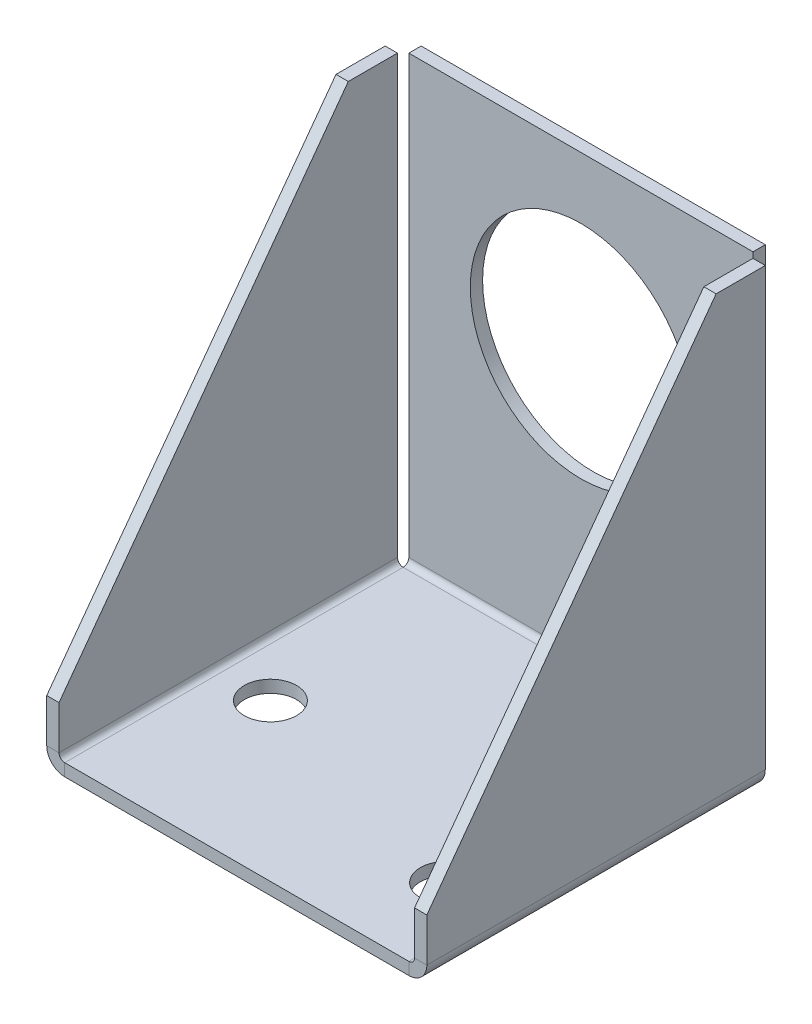
ISO-10303-21;
HEADER;
FILE_DESCRIPTION(('STEP AP214'),'2;1');
FILE_NAME('part.step','',(''),(''),'','','');
FILE_SCHEMA(('AUTOMOTIVE_DESIGN { 1 0 10303 214 1 1 1 1 }'));
ENDSEC;
DATA;
#1=APPLICATION_CONTEXT('core data for automotive mechanical design processes');
#2=APPLICATION_PROTOCOL_DEFINITION('international standard','automotive_design',2000,#1);
#3=PRODUCT_CONTEXT('',#1,'mechanical');
#4=PRODUCT('Part','Part','',(#3));
#5=PRODUCT_RELATED_PRODUCT_CATEGORY('part','',(#4));
#6=PRODUCT_DEFINITION_FORMATION('','',#4);
#7=PRODUCT_DEFINITION_CONTEXT('part definition',#1,'design');
#8=PRODUCT_DEFINITION('design','',#6,#7);
#9=PRODUCT_DEFINITION_SHAPE('','',#8);
#10=(LENGTH_UNIT() NAMED_UNIT(*) SI_UNIT(.MILLI.,.METRE.));
#11=(NAMED_UNIT(*) PLANE_ANGLE_UNIT() SI_UNIT($,.RADIAN.));
#12=(NAMED_UNIT(*) SI_UNIT($,.STERADIAN.) SOLID_ANGLE_UNIT());
#13=UNCERTAINTY_MEASURE_WITH_UNIT(LENGTH_MEASURE(1.E-05),#10,'distance_accuracy_value','');
#14=(GEOMETRIC_REPRESENTATION_CONTEXT(3) GLOBAL_UNCERTAINTY_ASSIGNED_CONTEXT((#13)) GLOBAL_UNIT_ASSIGNED_CONTEXT((#10,
#11,#12)) REPRESENTATION_CONTEXT('',''));
#15=CARTESIAN_POINT('',(0.,0.,0.));
#16=DIRECTION('',(0.,0.,1.));
#17=DIRECTION('',(1.,0.,0.));
#18=AXIS2_PLACEMENT_3D('',#15,#16,#17);
#19=CARTESIAN_POINT('',(44.45,0.7366,-44.45));
#20=DIRECTION('',(1.,0.,0.));
#21=DIRECTION('',(0.,0.,-1.));
#22=AXIS2_PLACEMENT_3D('',#19,#20,#21);
#23=PLANE('',#22);
#24=DIRECTION('',(0.,0.,-1.));
#25=VECTOR('',#24,1.);
#26=CARTESIAN_POINT('',(44.45,0.7366,-44.45));
#27=LINE('',#26,#25);
#28=CARTESIAN_POINT('',(44.45,0.7366,-44.45));
#29=VERTEX_POINT('',#28);
#30=CARTESIAN_POINT('',(44.45,0.7366,-46.0375));
#31=VERTEX_POINT('',#30);
#32=EDGE_CURVE('E13',#29,#31,#27,.T.);
#33=ORIENTED_EDGE('',*,*,#32,.F.);
#34=CARTESIAN_POINT('',(44.45,0.7366,-43.7134));
#35=DIRECTION('',(-1.,0.,0.));
#36=DIRECTION('',(0.,0.,1.));
#37=AXIS2_PLACEMENT_3D('',#34,#35,#36);
#38=CIRCLE('',#37,0.7366);
#39=CARTESIAN_POINT('',(44.45,0.,-43.7134));
#40=VERTEX_POINT('',#39);
#41=EDGE_CURVE('E197',#40,#29,#38,.F.);
#42=ORIENTED_EDGE('',*,*,#41,.F.);
#43=DIRECTION('',(0.,1.,0.));
#44=VECTOR('',#43,1.);
#45=CARTESIAN_POINT('',(44.45,-1.5875,-43.7134));
#46=LINE('',#45,#44);
#47=CARTESIAN_POINT('',(44.45,-1.5875,-43.7134));
#48=VERTEX_POINT('',#47);
#49=EDGE_CURVE('E103',#48,#40,#46,.T.);
#50=ORIENTED_EDGE('',*,*,#49,.F.);
#51=CARTESIAN_POINT('',(44.45,0.7366,-43.7134));
#52=DIRECTION('',(1.,0.,0.));
#53=DIRECTION('',(0.,0.,-1.));
#54=AXIS2_PLACEMENT_3D('',#51,#52,#53);
#55=CIRCLE('',#54,2.3241);
#56=EDGE_CURVE('E279',#48,#31,#55,.T.);
#57=ORIENTED_EDGE('',*,*,#56,.T.);
#58=EDGE_LOOP('',(#33,#42,#50,#57));
#59=FACE_BOUND('',#58,.T.);
#60=ADVANCED_FACE('F94',(#59),#23,.T.);
#61=CARTESIAN_POINT('',(44.45,-1.5875,-43.7134));
#62=DIRECTION('',(1.,0.,0.));
#63=DIRECTION('',(0.,0.,-1.));
#64=AXIS2_PLACEMENT_3D('',#61,#62,#63);
#65=PLANE('',#64);
#66=DIRECTION('',(0.,1.,0.));
#67=VECTOR('',#66,1.);
#68=CARTESIAN_POINT('',(44.45,0.,-44.45));
#69=LINE('',#68,#67);
#70=CARTESIAN_POINT('',(44.45,57.15,-44.45));
#71=VERTEX_POINT('',#70);
#72=EDGE_CURVE('E272',#29,#71,#69,.T.);
#73=ORIENTED_EDGE('',*,*,#72,.F.);
#74=ORIENTED_EDGE('',*,*,#32,.T.);
#75=DIRECTION('',(0.,1.,0.));
#76=VECTOR('',#75,1.);
#77=CARTESIAN_POINT('',(44.45,0.,-46.0375));
#78=LINE('',#77,#76);
#79=CARTESIAN_POINT('',(44.45,57.15,-46.0375));
#80=VERTEX_POINT('',#79);
#81=EDGE_CURVE('E144',#31,#80,#78,.T.);
#82=ORIENTED_EDGE('',*,*,#81,.T.);
#83=DIRECTION('',(0.,0.,-1.));
#84=VECTOR('',#83,1.);
#85=CARTESIAN_POINT('',(44.45,57.15,-44.45));
#86=LINE('',#85,#84);
#87=EDGE_CURVE('E268',#71,#80,#86,.T.);
#88=ORIENTED_EDGE('',*,*,#87,.F.);
#89=EDGE_LOOP('',(#73,#74,#82,#88));
#90=FACE_BOUND('',#89,.T.);
#91=ADVANCED_FACE('F363',(#90),#65,.T.);
#92=CARTESIAN_POINT('',(0.,0.,-43.7134));
#93=DIRECTION('',(-1.,0.,0.));
#94=DIRECTION('',(0.,0.,1.));
#95=AXIS2_PLACEMENT_3D('',#92,#93,#94);
#96=PLANE('',#95);
#97=DIRECTION('',(0.,-1.,0.));
#98=VECTOR('',#97,1.);
#99=CARTESIAN_POINT('',(0.,0.,-43.7134));
#100=LINE('',#99,#98);
#101=CARTESIAN_POINT('',(0.,0.,-43.7134));
#102=VERTEX_POINT('',#101);
#103=CARTESIAN_POINT('',(0.,-1.5875,-43.7134));
#104=VERTEX_POINT('',#103);
#105=EDGE_CURVE('E315',#102,#104,#100,.T.);
#106=ORIENTED_EDGE('',*,*,#105,.F.);
#107=CARTESIAN_POINT('',(0.,0.7366,-43.7134));
#108=DIRECTION('',(-1.,0.,0.));
#109=DIRECTION('',(0.,0.,1.));
#110=AXIS2_PLACEMENT_3D('',#107,#108,#109);
#111=CIRCLE('',#110,0.7366);
#112=CARTESIAN_POINT('',(0.,0.7366,-44.45));
#113=VERTEX_POINT('',#112);
#114=EDGE_CURVE('E290',#102,#113,#111,.F.);
#115=ORIENTED_EDGE('',*,*,#114,.T.);
#116=DIRECTION('',(0.,0.,1.));
#117=VECTOR('',#116,1.);
#118=CARTESIAN_POINT('',(0.,0.7366,-46.0375));
#119=LINE('',#118,#117);
#120=CARTESIAN_POINT('',(0.,0.7366,-46.0375));
#121=VERTEX_POINT('',#120);
#122=EDGE_CURVE('E138',#121,#113,#119,.T.);
#123=ORIENTED_EDGE('',*,*,#122,.F.);
#124=CARTESIAN_POINT('',(0.,0.7366,-43.7134));
#125=DIRECTION('',(1.,0.,0.));
#126=DIRECTION('',(0.,0.,-1.));
#127=AXIS2_PLACEMENT_3D('',#124,#125,#126);
#128=CIRCLE('',#127,2.3241);
#129=EDGE_CURVE('E269',#104,#121,#128,.T.);
#130=ORIENTED_EDGE('',*,*,#129,.F.);
#131=EDGE_LOOP('',(#106,#115,#123,#130));
#132=FACE_BOUND('',#131,.T.);
#133=ADVANCED_FACE('F342',(#132),#96,.T.);
#134=CARTESIAN_POINT('',(44.45,0.,-46.0375));
#135=DIRECTION('',(0.,0.,1.));
#136=DIRECTION('',(1.,0.,0.));
#137=AXIS2_PLACEMENT_3D('',#134,#135,#136);
#138=PLANE('',#137);
#139=CARTESIAN_POINT('',(22.225,34.925,-46.0375));
#140=DIRECTION('',(0.,0.,-1.));
#141=DIRECTION('',(-1.,0.,0.));
#142=AXIS2_PLACEMENT_3D('',#139,#140,#141);
#143=CIRCLE('',#142,14.2875);
#144=CARTESIAN_POINT('',(7.93749999999999,34.925,-46.0375));
#145=VERTEX_POINT('',#144);
#146=EDGE_CURVE('E485',#145,#145,#143,.T.);
#147=ORIENTED_EDGE('',*,*,#146,.F.);
#148=EDGE_LOOP('',(#147));
#149=FACE_BOUND('',#148,.T.);
#150=DIRECTION('',(0.,1.,0.));
#151=VECTOR('',#150,1.);
#152=CARTESIAN_POINT('',(0.,0.,-46.0375));
#153=LINE('',#152,#151);
#154=CARTESIAN_POINT('',(0.,57.15,-46.0375));
#155=VERTEX_POINT('',#154);
#156=EDGE_CURVE('E258',#121,#155,#153,.T.);
#157=ORIENTED_EDGE('',*,*,#156,.T.);
#158=DIRECTION('',(-1.,0.,0.));
#159=VECTOR('',#158,1.);
#160=CARTESIAN_POINT('',(44.45,57.15,-46.0375));
#161=LINE('',#160,#159);
#162=EDGE_CURVE('E312',#80,#155,#161,.T.);
#163=ORIENTED_EDGE('',*,*,#162,.F.);
#164=ORIENTED_EDGE('',*,*,#81,.F.);
#165=DIRECTION('',(-1.,0.,0.));
#166=VECTOR('',#165,1.);
#167=CARTESIAN_POINT('',(44.45,0.7366,-46.0375));
#168=LINE('',#167,#166);
#169=EDGE_CURVE('E281',#31,#121,#168,.T.);
#170=ORIENTED_EDGE('',*,*,#169,.T.);
#171=EDGE_LOOP('',(#157,#163,#164,#170));
#172=FACE_BOUND('',#171,.T.);
#173=ADVANCED_FACE('F360',(#149,#172),#138,.F.);
#174=CARTESIAN_POINT('',(44.45,57.15,-44.45));
#175=DIRECTION('',(0.,1.,0.));
#176=DIRECTION('',(0.,0.,1.));
#177=AXIS2_PLACEMENT_3D('',#174,#175,#176);
#178=PLANE('',#177);
#179=DIRECTION('',(0.,0.,-1.));
#180=VECTOR('',#179,1.);
#181=CARTESIAN_POINT('',(0.,57.15,-44.45));
#182=LINE('',#181,#180);
#183=CARTESIAN_POINT('',(0.,57.15,-44.45));
#184=VERTEX_POINT('',#183);
#185=EDGE_CURVE('E284',#184,#155,#182,.T.);
#186=ORIENTED_EDGE('',*,*,#185,.F.);
#187=DIRECTION('',(-1.,0.,0.));
#188=VECTOR('',#187,1.);
#189=CARTESIAN_POINT('',(44.45,57.15,-44.45));
#190=LINE('',#189,#188);
#191=EDGE_CURVE('E310',#71,#184,#190,.T.);
#192=ORIENTED_EDGE('',*,*,#191,.F.);
#193=ORIENTED_EDGE('',*,*,#87,.T.);
#194=ORIENTED_EDGE('',*,*,#162,.T.);
#195=EDGE_LOOP('',(#186,#192,#193,#194));
#196=FACE_BOUND('',#195,.T.);
#197=ADVANCED_FACE('F362',(#196),#178,.T.);
#198=CARTESIAN_POINT('',(44.45,0.,-44.45));
#199=DIRECTION('',(0.,0.,1.));
#200=DIRECTION('',(1.,0.,0.));
#201=AXIS2_PLACEMENT_3D('',#198,#199,#200);
#202=PLANE('',#201);
#203=CARTESIAN_POINT('',(22.225,34.925,-44.45));
#204=DIRECTION('',(0.,0.,1.));
#205=DIRECTION('',(1.,0.,0.));
#206=AXIS2_PLACEMENT_3D('',#203,#204,#205);
#207=CIRCLE('',#206,14.2875);
#208=CARTESIAN_POINT('',(36.5125,34.925,-44.45));
#209=VERTEX_POINT('',#208);
#210=EDGE_CURVE('E97',#209,#209,#207,.T.);
#211=ORIENTED_EDGE('',*,*,#210,.F.);
#212=EDGE_LOOP('',(#211));
#213=FACE_BOUND('',#212,.T.);
#214=DIRECTION('',(0.,1.,0.));
#215=VECTOR('',#214,1.);
#216=CARTESIAN_POINT('',(0.,0.,-44.45));
#217=LINE('',#216,#215);
#218=EDGE_CURVE('E287',#113,#184,#217,.T.);
#219=ORIENTED_EDGE('',*,*,#218,.F.);
#220=DIRECTION('',(-1.,0.,0.));
#221=VECTOR('',#220,1.);
#222=CARTESIAN_POINT('',(44.45,0.7366,-44.45));
#223=LINE('',#222,#221);
#224=EDGE_CURVE('E307',#29,#113,#223,.T.);
#225=ORIENTED_EDGE('',*,*,#224,.F.);
#226=ORIENTED_EDGE('',*,*,#72,.T.);
#227=ORIENTED_EDGE('',*,*,#191,.T.);
#228=EDGE_LOOP('',(#219,#225,#226,#227));
#229=FACE_BOUND('',#228,.T.);
#230=ADVANCED_FACE('F354',(#213,#229),#202,.T.);
#231=CARTESIAN_POINT('',(44.45,0.7366,-43.7134));
#232=DIRECTION('',(-1.,0.,0.));
#233=DIRECTION('',(0.,0.,1.));
#234=AXIS2_PLACEMENT_3D('',#231,#232,#233);
#235=CYLINDRICAL_SURFACE('',#234,0.7366);
#236=ORIENTED_EDGE('',*,*,#114,.F.);
#237=DIRECTION('',(-1.,0.,0.));
#238=VECTOR('',#237,1.);
#239=CARTESIAN_POINT('',(44.45,0.,-43.7134));
#240=LINE('',#239,#238);
#241=EDGE_CURVE('E173',#40,#102,#240,.T.);
#242=ORIENTED_EDGE('',*,*,#241,.F.);
#243=ORIENTED_EDGE('',*,*,#41,.T.);
#244=ORIENTED_EDGE('',*,*,#224,.T.);
#245=EDGE_LOOP('',(#236,#242,#243,#244));
#246=FACE_BOUND('',#245,.T.);
#247=ADVANCED_FACE('F350',(#246),#235,.F.);
#248=CARTESIAN_POINT('',(44.45,0.,0.));
#249=DIRECTION('',(0.,1.,0.));
#250=DIRECTION('',(0.,0.,1.));
#251=AXIS2_PLACEMENT_3D('',#248,#249,#250);
#252=PLANE('',#251);
#253=CARTESIAN_POINT('',(38.0844298,0.,-11.2395));
#254=DIRECTION('',(0.,1.,0.));
#255=DIRECTION('',(0.,0.,1.));
#256=AXIS2_PLACEMENT_3D('',#253,#254,#255);
#257=CIRCLE('',#256,3.37820000000001);
#258=CARTESIAN_POINT('',(38.0844298,0.,-7.86129999999998));
#259=VERTEX_POINT('',#258);
#260=EDGE_CURVE('E482',#259,#259,#257,.T.);
#261=ORIENTED_EDGE('',*,*,#260,.F.);
#262=EDGE_LOOP('',(#261));
#263=FACE_BOUND('',#262,.T.);
#264=CARTESIAN_POINT('',(6.33442979999997,0.,-20.2359708844596));
#265=DIRECTION('',(0.,1.,0.));
#266=DIRECTION('',(0.,0.,1.));
#267=AXIS2_PLACEMENT_3D('',#264,#265,#266);
#268=CIRCLE('',#267,3.37819999999999);
#269=CARTESIAN_POINT('',(6.33442979999997,0.,-16.8577708844596));
#270=VERTEX_POINT('',#269);
#271=EDGE_CURVE('E488',#270,#270,#268,.T.);
#272=ORIENTED_EDGE('',*,*,#271,.F.);
#273=EDGE_LOOP('',(#272));
#274=FACE_BOUND('',#273,.T.);
#275=DIRECTION('',(0.,0.,-1.));
#276=VECTOR('',#275,1.);
#277=CARTESIAN_POINT('',(0.,0.,0.));
#278=LINE('',#277,#276);
#279=CARTESIAN_POINT('',(0.,0.,0.));
#280=VERTEX_POINT('',#279);
#281=EDGE_CURVE('E170',#280,#102,#278,.T.);
#282=ORIENTED_EDGE('',*,*,#281,.F.);
#283=DIRECTION('',(-1.,0.,0.));
#284=VECTOR('',#283,1.);
#285=CARTESIAN_POINT('',(44.45,0.,0.));
#286=LINE('',#285,#284);
#287=CARTESIAN_POINT('',(44.45,0.,0.));
#288=VERTEX_POINT('',#287);
#289=EDGE_CURVE('E161',#288,#280,#286,.T.);
#290=ORIENTED_EDGE('',*,*,#289,.F.);
#291=DIRECTION('',(0.,0.,-1.));
#292=VECTOR('',#291,1.);
#293=CARTESIAN_POINT('',(44.45,0.,0.));
#294=LINE('',#293,#292);
#295=EDGE_CURVE('E166',#288,#40,#294,.T.);
#296=ORIENTED_EDGE('',*,*,#295,.T.);
#297=ORIENTED_EDGE('',*,*,#241,.T.);
#298=EDGE_LOOP('',(#282,#290,#296,#297));
#299=FACE_BOUND('',#298,.T.);
#300=ADVANCED_FACE('F163',(#263,#274,#299),#252,.T.);
#301=CARTESIAN_POINT('',(44.45,-1.5875,0.));
#302=DIRECTION('',(0.,0.,1.));
#303=DIRECTION('',(1.,0.,0.));
#304=AXIS2_PLACEMENT_3D('',#301,#302,#303);
#305=PLANE('',#304);
#306=DIRECTION('',(0.,1.,0.));
#307=VECTOR('',#306,1.);
#308=CARTESIAN_POINT('',(0.,-1.5875,0.));
#309=LINE('',#308,#307);
#310=CARTESIAN_POINT('',(0.,-1.5875,0.));
#311=VERTEX_POINT('',#310);
#312=EDGE_CURVE('E293',#311,#280,#309,.T.);
#313=ORIENTED_EDGE('',*,*,#312,.F.);
#314=DIRECTION('',(-1.,0.,0.));
#315=VECTOR('',#314,1.);
#316=CARTESIAN_POINT('',(44.45,-1.5875,0.));
#317=LINE('',#316,#315);
#318=CARTESIAN_POINT('',(44.45,-1.5875,0.));
#319=VERTEX_POINT('',#318);
#320=EDGE_CURVE('E174',#319,#311,#317,.T.);
#321=ORIENTED_EDGE('',*,*,#320,.F.);
#322=DIRECTION('',(0.,1.,0.));
#323=VECTOR('',#322,1.);
#324=CARTESIAN_POINT('',(44.45,-1.5875,0.));
#325=LINE('',#324,#323);
#326=EDGE_CURVE('E177',#319,#288,#325,.T.);
#327=ORIENTED_EDGE('',*,*,#326,.T.);
#328=ORIENTED_EDGE('',*,*,#289,.T.);
#329=EDGE_LOOP('',(#313,#321,#327,#328));
#330=FACE_BOUND('',#329,.T.);
#331=ADVANCED_FACE('F178',(#330),#305,.T.);
#332=CARTESIAN_POINT('',(44.45,-1.5875,0.));
#333=DIRECTION('',(0.,1.,0.));
#334=DIRECTION('',(0.,0.,1.));
#335=AXIS2_PLACEMENT_3D('',#332,#333,#334);
#336=PLANE('',#335);
#337=CARTESIAN_POINT('',(38.0844298,-1.5875,-11.2395));
#338=DIRECTION('',(0.,1.,0.));
#339=DIRECTION('',(0.,0.,1.));
#340=AXIS2_PLACEMENT_3D('',#337,#338,#339);
#341=CIRCLE('',#340,3.37820000000001);
#342=CARTESIAN_POINT('',(38.0844298,-1.5875,-7.86129999999998));
#343=VERTEX_POINT('',#342);
#344=EDGE_CURVE('E479',#343,#343,#341,.T.);
#345=ORIENTED_EDGE('',*,*,#344,.T.);
#346=EDGE_LOOP('',(#345));
#347=FACE_BOUND('',#346,.T.);
#348=CARTESIAN_POINT('',(6.33442979999997,-1.5875,-20.2359708844596));
#349=DIRECTION('',(0.,1.,0.));
#350=DIRECTION('',(0.,0.,1.));
#351=AXIS2_PLACEMENT_3D('',#348,#349,#350);
#352=CIRCLE('',#351,3.37819999999999);
#353=CARTESIAN_POINT('',(6.33442979999997,-1.5875,-16.8577708844596));
#354=VERTEX_POINT('',#353);
#355=EDGE_CURVE('E483',#354,#354,#352,.T.);
#356=ORIENTED_EDGE('',*,*,#355,.T.);
#357=EDGE_LOOP('',(#356));
#358=FACE_BOUND('',#357,.T.);
#359=DIRECTION('',(0.,0.,-1.));
#360=VECTOR('',#359,1.);
#361=CARTESIAN_POINT('',(0.,-1.5875,0.));
#362=LINE('',#361,#360);
#363=EDGE_CURVE('E296',#311,#104,#362,.T.);
#364=ORIENTED_EDGE('',*,*,#363,.T.);
#365=DIRECTION('',(-1.,0.,0.));
#366=VECTOR('',#365,1.);
#367=CARTESIAN_POINT('',(44.45,-1.5875,-43.7134));
#368=LINE('',#367,#366);
#369=EDGE_CURVE('E302',#48,#104,#368,.T.);
#370=ORIENTED_EDGE('',*,*,#369,.F.);
#371=DIRECTION('',(0.,0.,-1.));
#372=VECTOR('',#371,1.);
#373=CARTESIAN_POINT('',(44.45,-1.5875,0.));
#374=LINE('',#373,#372);
#375=EDGE_CURVE('E185',#319,#48,#374,.T.);
#376=ORIENTED_EDGE('',*,*,#375,.F.);
#377=ORIENTED_EDGE('',*,*,#320,.T.);
#378=EDGE_LOOP('',(#364,#370,#376,#377));
#379=FACE_BOUND('',#378,.T.);
#380=ADVANCED_FACE('F338',(#347,#358,#379),#336,.F.);
#381=CARTESIAN_POINT('',(44.45,0.7366,-43.7134));
#382=DIRECTION('',(-1.,0.,0.));
#383=DIRECTION('',(0.,0.,1.));
#384=AXIS2_PLACEMENT_3D('',#381,#382,#383);
#385=CYLINDRICAL_SURFACE('',#384,2.3241);
#386=ORIENTED_EDGE('',*,*,#129,.T.);
#387=ORIENTED_EDGE('',*,*,#169,.F.);
#388=ORIENTED_EDGE('',*,*,#56,.F.);
#389=ORIENTED_EDGE('',*,*,#369,.T.);
#390=EDGE_LOOP('',(#386,#387,#388,#389));
#391=FACE_BOUND('',#390,.T.);
#392=ADVANCED_FACE('F340',(#391),#385,.T.);
#393=CARTESIAN_POINT('',(0.,0.7366,-43.7134));
#394=DIRECTION('',(-1.,0.,0.));
#395=DIRECTION('',(0.,0.,1.));
#396=AXIS2_PLACEMENT_3D('',#393,#394,#395);
#397=PLANE('',#396);
#398=ORIENTED_EDGE('',*,*,#156,.F.);
#399=ORIENTED_EDGE('',*,*,#122,.T.);
#400=ORIENTED_EDGE('',*,*,#218,.T.);
#401=ORIENTED_EDGE('',*,*,#185,.T.);
#402=EDGE_LOOP('',(#398,#399,#400,#401));
#403=FACE_BOUND('',#402,.T.);
#404=ADVANCED_FACE('F358',(#403),#397,.T.);
#405=CARTESIAN_POINT('',(0.,0.7366,-43.7134));
#406=DIRECTION('',(0.,0.,-1.));
#407=DIRECTION('',(-1.,0.,0.));
#408=AXIS2_PLACEMENT_3D('',#405,#406,#407);
#409=PLANE('',#408);
#410=DIRECTION('',(1.,0.,0.));
#411=VECTOR('',#410,1.);
#412=CARTESIAN_POINT('',(-2.3241,0.736599999999992,-43.7134));
#413=LINE('',#412,#411);
#414=CARTESIAN_POINT('',(-0.7366,0.736599999999997,-43.7134));
#415=VERTEX_POINT('',#414);
#416=CARTESIAN_POINT('',(-2.3241,0.736599999999992,-43.7134));
#417=VERTEX_POINT('',#416);
#418=EDGE_CURVE('E254',#415,#417,#413,.F.);
#419=ORIENTED_EDGE('',*,*,#418,.F.);
#420=CARTESIAN_POINT('',(0.,0.7366,-43.7134));
#421=DIRECTION('',(0.,0.,1.));
#422=DIRECTION('',(1.,0.,0.));
#423=AXIS2_PLACEMENT_3D('',#420,#421,#422);
#424=CIRCLE('',#423,0.736599999999998);
#425=EDGE_CURVE('E262',#102,#415,#424,.F.);
#426=ORIENTED_EDGE('',*,*,#425,.F.);
#427=ORIENTED_EDGE('',*,*,#105,.T.);
#428=CARTESIAN_POINT('',(0.,0.7366,-43.7134));
#429=DIRECTION('',(0.,0.,1.));
#430=DIRECTION('',(1.,0.,0.));
#431=AXIS2_PLACEMENT_3D('',#428,#429,#430);
#432=CIRCLE('',#431,2.3241);
#433=EDGE_CURVE('E131',#104,#417,#432,.F.);
#434=ORIENTED_EDGE('',*,*,#433,.T.);
#435=EDGE_LOOP('',(#419,#426,#427,#434));
#436=FACE_BOUND('',#435,.T.);
#437=ADVANCED_FACE('F393',(#436),#409,.T.);
#438=CARTESIAN_POINT('',(0.,0.7366,0.));
#439=DIRECTION('',(0.,0.,-1.));
#440=DIRECTION('',(-1.,0.,0.));
#441=AXIS2_PLACEMENT_3D('',#438,#439,#440);
#442=PLANE('',#441);
#443=CARTESIAN_POINT('',(0.,0.7366,0.));
#444=DIRECTION('',(0.,0.,1.));
#445=DIRECTION('',(1.,0.,0.));
#446=AXIS2_PLACEMENT_3D('',#443,#444,#445);
#447=CIRCLE('',#446,0.736599999999998);
#448=CARTESIAN_POINT('',(-0.736599999999997,0.736599999999997,0.));
#449=VERTEX_POINT('',#448);
#450=EDGE_CURVE('E215',#449,#280,#447,.T.);
#451=ORIENTED_EDGE('',*,*,#450,.F.);
#452=DIRECTION('',(1.,0.,0.));
#453=VECTOR('',#452,1.);
#454=CARTESIAN_POINT('',(-0.7366,0.736599999999997,0.));
#455=LINE('',#454,#453);
#456=CARTESIAN_POINT('',(-2.3241,0.736599999999992,0.));
#457=VERTEX_POINT('',#456);
#458=EDGE_CURVE('E248',#449,#457,#455,.F.);
#459=ORIENTED_EDGE('',*,*,#458,.T.);
#460=CARTESIAN_POINT('',(0.,0.7366,0.));
#461=DIRECTION('',(0.,0.,1.));
#462=DIRECTION('',(1.,0.,0.));
#463=AXIS2_PLACEMENT_3D('',#460,#461,#462);
#464=CIRCLE('',#463,2.3241);
#465=EDGE_CURVE('E259',#457,#311,#464,.T.);
#466=ORIENTED_EDGE('',*,*,#465,.T.);
#467=ORIENTED_EDGE('',*,*,#312,.T.);
#468=EDGE_LOOP('',(#451,#459,#466,#467));
#469=FACE_BOUND('',#468,.T.);
#470=ADVANCED_FACE('F394',(#469),#442,.F.);
#471=CARTESIAN_POINT('',(0.,0.7366,0.));
#472=DIRECTION('',(0.,0.,1.));
#473=DIRECTION('',(-1.,0.,0.));
#474=AXIS2_PLACEMENT_3D('',#471,#472,#473);
#475=CYLINDRICAL_SURFACE('',#474,2.3241);
#476=ORIENTED_EDGE('',*,*,#363,.F.);
#477=ORIENTED_EDGE('',*,*,#465,.F.);
#478=DIRECTION('',(0.,0.,1.));
#479=VECTOR('',#478,1.);
#480=CARTESIAN_POINT('',(-2.3241,0.736599999999992,-43.7134));
#481=LINE('',#480,#479);
#482=EDGE_CURVE('E246',#457,#417,#481,.F.);
#483=ORIENTED_EDGE('',*,*,#482,.T.);
#484=ORIENTED_EDGE('',*,*,#433,.F.);
#485=EDGE_LOOP('',(#476,#477,#483,#484));
#486=FACE_BOUND('',#485,.T.);
#487=ADVANCED_FACE('F397',(#486),#475,.T.);
#488=CARTESIAN_POINT('',(0.,0.7366,0.));
#489=DIRECTION('',(0.,0.,1.));
#490=DIRECTION('',(-1.,0.,0.));
#491=AXIS2_PLACEMENT_3D('',#488,#489,#490);
#492=CYLINDRICAL_SURFACE('',#491,0.736599999999998);
#493=ORIENTED_EDGE('',*,*,#281,.T.);
#494=ORIENTED_EDGE('',*,*,#425,.T.);
#495=DIRECTION('',(0.,0.,1.));
#496=VECTOR('',#495,1.);
#497=CARTESIAN_POINT('',(-0.7366,0.736599999999997,-43.7134));
#498=LINE('',#497,#496);
#499=EDGE_CURVE('E251',#415,#449,#498,.T.);
#500=ORIENTED_EDGE('',*,*,#499,.T.);
#501=ORIENTED_EDGE('',*,*,#450,.T.);
#502=EDGE_LOOP('',(#493,#494,#500,#501));
#503=FACE_BOUND('',#502,.T.);
#504=ADVANCED_FACE('F401',(#503),#492,.F.);
#505=CARTESIAN_POINT('',(-2.32410000000002,6.34999999999999,0.));
#506=DIRECTION('',(0.,0.,-1.));
#507=DIRECTION('',(0.,1.,0.));
#508=AXIS2_PLACEMENT_3D('',#505,#506,#507);
#509=PLANE('',#508);
#510=ORIENTED_EDGE('',*,*,#458,.F.);
#511=DIRECTION('',(0.,-1.,0.));
#512=VECTOR('',#511,1.);
#513=CARTESIAN_POINT('',(-0.73660000000002,6.35,0.));
#514=LINE('',#513,#512);
#515=CARTESIAN_POINT('',(-0.73660000000002,6.35,0.));
#516=VERTEX_POINT('',#515);
#517=EDGE_CURVE('E243',#449,#516,#514,.F.);
#518=ORIENTED_EDGE('',*,*,#517,.T.);
#519=DIRECTION('',(1.,0.,0.));
#520=VECTOR('',#519,1.);
#521=CARTESIAN_POINT('',(-2.32410000000002,6.34999999999999,0.));
#522=LINE('',#521,#520);
#523=CARTESIAN_POINT('',(-2.32410000000002,6.35,0.));
#524=VERTEX_POINT('',#523);
#525=EDGE_CURVE('E212',#524,#516,#522,.T.);
#526=ORIENTED_EDGE('',*,*,#525,.F.);
#527=DIRECTION('',(0.,1.,0.));
#528=VECTOR('',#527,1.);
#529=CARTESIAN_POINT('',(-2.3241,0.,0.));
#530=LINE('',#529,#528);
#531=EDGE_CURVE('E231',#457,#524,#530,.T.);
#532=ORIENTED_EDGE('',*,*,#531,.F.);
#533=EDGE_LOOP('',(#510,#518,#526,#532));
#534=FACE_BOUND('',#533,.T.);
#535=ADVANCED_FACE('F404',(#534),#509,.F.);
#536=CARTESIAN_POINT('',(-2.3241,0.,-43.7134));
#537=DIRECTION('',(0.,0.,1.));
#538=DIRECTION('',(1.,0.,0.));
#539=AXIS2_PLACEMENT_3D('',#536,#537,#538);
#540=PLANE('',#539);
#541=ORIENTED_EDGE('',*,*,#418,.T.);
#542=DIRECTION('',(0.,-1.,0.));
#543=VECTOR('',#542,1.);
#544=CARTESIAN_POINT('',(-2.3241,0.,-43.7134));
#545=LINE('',#544,#543);
#546=CARTESIAN_POINT('',(-2.3241000000002,57.15,-43.7134));
#547=VERTEX_POINT('',#546);
#548=EDGE_CURVE('E222',#547,#417,#545,.T.);
#549=ORIENTED_EDGE('',*,*,#548,.F.);
#550=DIRECTION('',(1.,0.,0.));
#551=VECTOR('',#550,1.);
#552=CARTESIAN_POINT('',(-2.3241000000002,57.15,-43.7134));
#553=LINE('',#552,#551);
#554=CARTESIAN_POINT('',(-0.736600000000197,57.15,-43.7134));
#555=VERTEX_POINT('',#554);
#556=EDGE_CURVE('E219',#547,#555,#553,.T.);
#557=ORIENTED_EDGE('',*,*,#556,.T.);
#558=DIRECTION('',(0.,1.,0.));
#559=VECTOR('',#558,1.);
#560=CARTESIAN_POINT('',(-0.736599999999997,0.,-43.7134));
#561=LINE('',#560,#559);
#562=EDGE_CURVE('E234',#555,#415,#561,.F.);
#563=ORIENTED_EDGE('',*,*,#562,.T.);
#564=EDGE_LOOP('',(#541,#549,#557,#563));
#565=FACE_BOUND('',#564,.T.);
#566=ADVANCED_FACE('F410',(#565),#540,.F.);
#567=CARTESIAN_POINT('',(-2.3241,0.,0.));
#568=DIRECTION('',(1.,0.,0.));
#569=DIRECTION('',(0.,1.,0.));
#570=AXIS2_PLACEMENT_3D('',#567,#568,#569);
#571=PLANE('',#570);
#572=ORIENTED_EDGE('',*,*,#482,.F.);
#573=ORIENTED_EDGE('',*,*,#531,.T.);
#574=DIRECTION('',(0.,0.80557185044672,-0.592498096003563));
#575=VECTOR('',#574,1.);
#576=CARTESIAN_POINT('',(-2.3241,2.22919286042582,3.0308536511568));
#577=LINE('',#576,#575);
#578=CARTESIAN_POINT('',(-2.3241000000002,57.15,-37.3634));
#579=VERTEX_POINT('',#578);
#580=EDGE_CURVE('E228',#524,#579,#577,.T.);
#581=ORIENTED_EDGE('',*,*,#580,.T.);
#582=DIRECTION('',(0.,0.,-1.));
#583=VECTOR('',#582,1.);
#584=CARTESIAN_POINT('',(-2.3241000000002,57.15,0.));
#585=LINE('',#584,#583);
#586=EDGE_CURVE('E225',#579,#547,#585,.T.);
#587=ORIENTED_EDGE('',*,*,#586,.T.);
#588=ORIENTED_EDGE('',*,*,#548,.T.);
#589=EDGE_LOOP('',(#572,#573,#581,#587,#588));
#590=FACE_BOUND('',#589,.T.);
#591=ADVANCED_FACE('F423',(#590),#571,.F.);
#592=CARTESIAN_POINT('',(-0.736599999999997,0.,0.));
#593=DIRECTION('',(1.,0.,0.));
#594=DIRECTION('',(0.,1.,0.));
#595=AXIS2_PLACEMENT_3D('',#592,#593,#594);
#596=PLANE('',#595);
#597=ORIENTED_EDGE('',*,*,#517,.F.);
#598=ORIENTED_EDGE('',*,*,#499,.F.);
#599=ORIENTED_EDGE('',*,*,#562,.F.);
#600=DIRECTION('',(0.,0.,1.));
#601=VECTOR('',#600,1.);
#602=CARTESIAN_POINT('',(-0.736600000000197,57.15,-43.7134));
#603=LINE('',#602,#601);
#604=CARTESIAN_POINT('',(-0.736600000000197,57.15,-37.3634));
#605=VERTEX_POINT('',#604);
#606=EDGE_CURVE('E237',#605,#555,#603,.F.);
#607=ORIENTED_EDGE('',*,*,#606,.F.);
#608=DIRECTION('',(0.,-0.80557185044672,0.592498096003563));
#609=VECTOR('',#608,1.);
#610=CARTESIAN_POINT('',(-0.736600000000197,57.15,-37.3634));
#611=LINE('',#610,#609);
#612=EDGE_CURVE('E240',#516,#605,#611,.F.);
#613=ORIENTED_EDGE('',*,*,#612,.F.);
#614=EDGE_LOOP('',(#597,#598,#599,#607,#613));
#615=FACE_BOUND('',#614,.T.);
#616=ADVANCED_FACE('F416',(#615),#596,.T.);
#617=CARTESIAN_POINT('',(-2.3241000000002,57.15,-37.3634));
#618=DIRECTION('',(0.,-0.592498096003563,-0.80557185044672));
#619=DIRECTION('',(0.,0.80557185044672,-0.592498096003563));
#620=AXIS2_PLACEMENT_3D('',#617,#618,#619);
#621=PLANE('',#620);
#622=ORIENTED_EDGE('',*,*,#612,.T.);
#623=DIRECTION('',(1.,0.,0.));
#624=VECTOR('',#623,1.);
#625=CARTESIAN_POINT('',(-2.3241000000002,57.15,-37.3634));
#626=LINE('',#625,#624);
#627=EDGE_CURVE('E216',#579,#605,#626,.T.);
#628=ORIENTED_EDGE('',*,*,#627,.F.);
#629=ORIENTED_EDGE('',*,*,#580,.F.);
#630=ORIENTED_EDGE('',*,*,#525,.T.);
#631=EDGE_LOOP('',(#622,#628,#629,#630));
#632=FACE_BOUND('',#631,.T.);
#633=ADVANCED_FACE('F412',(#632),#621,.F.);
#634=CARTESIAN_POINT('',(-2.3241000000002,57.15,-43.7134));
#635=DIRECTION('',(0.,-1.,0.));
#636=DIRECTION('',(1.,0.,0.));
#637=AXIS2_PLACEMENT_3D('',#634,#635,#636);
#638=PLANE('',#637);
#639=ORIENTED_EDGE('',*,*,#606,.T.);
#640=ORIENTED_EDGE('',*,*,#556,.F.);
#641=ORIENTED_EDGE('',*,*,#586,.F.);
#642=ORIENTED_EDGE('',*,*,#627,.T.);
#643=EDGE_LOOP('',(#639,#640,#641,#642));
#644=FACE_BOUND('',#643,.T.);
#645=ADVANCED_FACE('F415',(#644),#638,.F.);
#646=CARTESIAN_POINT('',(44.45,0.736599999999999,0.));
#647=DIRECTION('',(0.,0.,1.));
#648=DIRECTION('',(1.,0.,0.));
#649=AXIS2_PLACEMENT_3D('',#646,#647,#648);
#650=PLANE('',#649);
#651=DIRECTION('',(-1.,0.,0.));
#652=VECTOR('',#651,1.);
#653=CARTESIAN_POINT('',(46.7741,0.736599999999992,0.));
#654=LINE('',#653,#652);
#655=CARTESIAN_POINT('',(45.1866,0.736599999999997,0.));
#656=VERTEX_POINT('',#655);
#657=CARTESIAN_POINT('',(46.7741,0.736599999999992,0.));
#658=VERTEX_POINT('',#657);
#659=EDGE_CURVE('E202',#656,#658,#654,.F.);
#660=ORIENTED_EDGE('',*,*,#659,.F.);
#661=CARTESIAN_POINT('',(44.45,0.736599999999999,0.));
#662=DIRECTION('',(0.,0.,-1.));
#663=DIRECTION('',(-1.,0.,0.));
#664=AXIS2_PLACEMENT_3D('',#661,#662,#663);
#665=CIRCLE('',#664,0.736600000000004);
#666=EDGE_CURVE('E193',#288,#656,#665,.F.);
#667=ORIENTED_EDGE('',*,*,#666,.F.);
#668=ORIENTED_EDGE('',*,*,#326,.F.);
#669=CARTESIAN_POINT('',(44.45,0.736599999999999,0.));
#670=DIRECTION('',(0.,0.,-1.));
#671=DIRECTION('',(-1.,0.,0.));
#672=AXIS2_PLACEMENT_3D('',#669,#670,#671);
#673=CIRCLE('',#672,2.3241);
#674=EDGE_CURVE('E206',#319,#658,#673,.F.);
#675=ORIENTED_EDGE('',*,*,#674,.T.);
#676=EDGE_LOOP('',(#660,#667,#668,#675));
#677=FACE_BOUND('',#676,.T.);
#678=ADVANCED_FACE('F200',(#677),#650,.T.);
#679=CARTESIAN_POINT('',(44.45,0.736599999999999,-43.7134));
#680=DIRECTION('',(0.,0.,1.));
#681=DIRECTION('',(1.,0.,0.));
#682=AXIS2_PLACEMENT_3D('',#679,#680,#681);
#683=PLANE('',#682);
#684=CARTESIAN_POINT('',(44.45,0.736599999999999,-43.7134));
#685=DIRECTION('',(0.,0.,-1.));
#686=DIRECTION('',(-1.,0.,0.));
#687=AXIS2_PLACEMENT_3D('',#684,#685,#686);
#688=CIRCLE('',#687,0.736600000000004);
#689=CARTESIAN_POINT('',(45.1866,0.736599999999997,-43.7134));
#690=VERTEX_POINT('',#689);
#691=EDGE_CURVE('E196',#690,#40,#688,.T.);
#692=ORIENTED_EDGE('',*,*,#691,.F.);
#693=DIRECTION('',(-1.,0.,0.));
#694=VECTOR('',#693,1.);
#695=CARTESIAN_POINT('',(45.1866,0.736599999999997,-43.7134));
#696=LINE('',#695,#694);
#697=CARTESIAN_POINT('',(46.7741,0.736599999999992,-43.7134));
#698=VERTEX_POINT('',#697);
#699=EDGE_CURVE('E529',#690,#698,#696,.F.);
#700=ORIENTED_EDGE('',*,*,#699,.T.);
#701=CARTESIAN_POINT('',(44.45,0.736599999999999,-43.7134));
#702=DIRECTION('',(0.,0.,-1.));
#703=DIRECTION('',(-1.,0.,0.));
#704=AXIS2_PLACEMENT_3D('',#701,#702,#703);
#705=CIRCLE('',#704,2.3241);
#706=EDGE_CURVE('E203',#698,#48,#705,.T.);
#707=ORIENTED_EDGE('',*,*,#706,.T.);
#708=ORIENTED_EDGE('',*,*,#49,.T.);
#709=EDGE_LOOP('',(#692,#700,#707,#708));
#710=FACE_BOUND('',#709,.T.);
#711=ADVANCED_FACE('F319',(#710),#683,.F.);
#712=CARTESIAN_POINT('',(44.45,0.736599999999999,-43.7134));
#713=DIRECTION('',(0.,0.,-1.));
#714=DIRECTION('',(1.,0.,0.));
#715=AXIS2_PLACEMENT_3D('',#712,#713,#714);
#716=CYLINDRICAL_SURFACE('',#715,2.3241);
#717=ORIENTED_EDGE('',*,*,#375,.T.);
#718=ORIENTED_EDGE('',*,*,#706,.F.);
#719=DIRECTION('',(0.,0.,-1.));
#720=VECTOR('',#719,1.);
#721=CARTESIAN_POINT('',(46.7741,0.736599999999992,0.));
#722=LINE('',#721,#720);
#723=EDGE_CURVE('E527',#698,#658,#722,.F.);
#724=ORIENTED_EDGE('',*,*,#723,.T.);
#725=ORIENTED_EDGE('',*,*,#674,.F.);
#726=EDGE_LOOP('',(#717,#718,#724,#725));
#727=FACE_BOUND('',#726,.T.);
#728=ADVANCED_FACE('F333',(#727),#716,.T.);
#729=CARTESIAN_POINT('',(44.45,0.736599999999999,-43.7134));
#730=DIRECTION('',(0.,0.,-1.));
#731=DIRECTION('',(1.,0.,0.));
#732=AXIS2_PLACEMENT_3D('',#729,#730,#731);
#733=CYLINDRICAL_SURFACE('',#732,0.736600000000004);
#734=ORIENTED_EDGE('',*,*,#295,.F.);
#735=ORIENTED_EDGE('',*,*,#666,.T.);
#736=DIRECTION('',(0.,0.,-1.));
#737=VECTOR('',#736,1.);
#738=CARTESIAN_POINT('',(45.1866,0.736599999999997,0.));
#739=LINE('',#738,#737);
#740=EDGE_CURVE('E531',#656,#690,#739,.T.);
#741=ORIENTED_EDGE('',*,*,#740,.T.);
#742=ORIENTED_EDGE('',*,*,#691,.T.);
#743=EDGE_LOOP('',(#734,#735,#741,#742));
#744=FACE_BOUND('',#743,.T.);
#745=ADVANCED_FACE('F190',(#744),#733,.F.);
#746=CARTESIAN_POINT('',(46.7741,0.,0.));
#747=DIRECTION('',(0.,0.,-1.));
#748=DIRECTION('',(-1.,0.,0.));
#749=AXIS2_PLACEMENT_3D('',#746,#747,#748);
#750=PLANE('',#749);
#751=ORIENTED_EDGE('',*,*,#659,.T.);
#752=DIRECTION('',(0.,-1.,0.));
#753=VECTOR('',#752,1.);
#754=CARTESIAN_POINT('',(46.7741,-1.51259498607465E-13,0.));
#755=LINE('',#754,#753);
#756=CARTESIAN_POINT('',(46.7741,6.35,0.));
#757=VERTEX_POINT('',#756);
#758=EDGE_CURVE('E512',#757,#658,#755,.T.);
#759=ORIENTED_EDGE('',*,*,#758,.F.);
#760=DIRECTION('',(-1.,0.,0.));
#761=VECTOR('',#760,1.);
#762=CARTESIAN_POINT('',(46.7741,6.35,0.));
#763=LINE('',#762,#761);
#764=CARTESIAN_POINT('',(45.1866,6.35000000000001,0.));
#765=VERTEX_POINT('',#764);
#766=EDGE_CURVE('E500',#757,#765,#763,.T.);
#767=ORIENTED_EDGE('',*,*,#766,.T.);
#768=DIRECTION('',(0.,1.,0.));
#769=VECTOR('',#768,1.);
#770=CARTESIAN_POINT('',(45.1866,0.,0.));
#771=LINE('',#770,#769);
#772=EDGE_CURVE('E524',#765,#656,#771,.F.);
#773=ORIENTED_EDGE('',*,*,#772,.T.);
#774=EDGE_LOOP('',(#751,#759,#767,#773));
#775=FACE_BOUND('',#774,.T.);
#776=ADVANCED_FACE('F437',(#775),#750,.F.);
#777=CARTESIAN_POINT('',(46.7741000000002,57.15,-43.7134));
#778=DIRECTION('',(0.,0.,1.));
#779=DIRECTION('',(0.,-1.,0.));
#780=AXIS2_PLACEMENT_3D('',#777,#778,#779);
#781=PLANE('',#780);
#782=ORIENTED_EDGE('',*,*,#699,.F.);
#783=DIRECTION('',(0.,-1.,0.));
#784=VECTOR('',#783,1.);
#785=CARTESIAN_POINT('',(45.1866000000002,57.15,-43.7134));
#786=LINE('',#785,#784);
#787=CARTESIAN_POINT('',(45.1866000000002,57.15,-43.7134));
#788=VERTEX_POINT('',#787);
#789=EDGE_CURVE('E521',#690,#788,#786,.F.);
#790=ORIENTED_EDGE('',*,*,#789,.T.);
#791=DIRECTION('',(-1.,0.,0.));
#792=VECTOR('',#791,1.);
#793=CARTESIAN_POINT('',(46.7741000000002,57.15,-43.7134));
#794=LINE('',#793,#792);
#795=CARTESIAN_POINT('',(46.7741000000002,57.15,-43.7134));
#796=VERTEX_POINT('',#795);
#797=EDGE_CURVE('E208',#796,#788,#794,.T.);
#798=ORIENTED_EDGE('',*,*,#797,.F.);
#799=DIRECTION('',(0.,1.,0.));
#800=VECTOR('',#799,1.);
#801=CARTESIAN_POINT('',(46.7741,-1.4064453291091E-13,-43.7134));
#802=LINE('',#801,#800);
#803=EDGE_CURVE('E509',#698,#796,#802,.T.);
#804=ORIENTED_EDGE('',*,*,#803,.F.);
#805=EDGE_LOOP('',(#782,#790,#798,#804));
#806=FACE_BOUND('',#805,.T.);
#807=ADVANCED_FACE('F442',(#806),#781,.F.);
#808=CARTESIAN_POINT('',(46.7741,-1.51259498607465E-13,0.));
#809=DIRECTION('',(-1.,0.,0.));
#810=DIRECTION('',(0.,-1.,0.));
#811=AXIS2_PLACEMENT_3D('',#808,#809,#810);
#812=PLANE('',#811);
#813=ORIENTED_EDGE('',*,*,#723,.F.);
#814=ORIENTED_EDGE('',*,*,#803,.T.);
#815=DIRECTION('',(0.,0.,1.));
#816=VECTOR('',#815,1.);
#817=CARTESIAN_POINT('',(46.7741000000002,57.15,0.));
#818=LINE('',#817,#816);
#819=CARTESIAN_POINT('',(46.7741000000002,57.15,-37.3634));
#820=VERTEX_POINT('',#819);
#821=EDGE_CURVE('E506',#796,#820,#818,.T.);
#822=ORIENTED_EDGE('',*,*,#821,.T.);
#823=DIRECTION('',(0.,-0.80557185044672,0.592498096003563));
#824=VECTOR('',#823,1.);
#825=CARTESIAN_POINT('',(46.7741,2.22919286042573,3.03085365115688));
#826=LINE('',#825,#824);
#827=EDGE_CURVE('E503',#820,#757,#826,.T.);
#828=ORIENTED_EDGE('',*,*,#827,.T.);
#829=ORIENTED_EDGE('',*,*,#758,.T.);
#830=EDGE_LOOP('',(#813,#814,#822,#828,#829));
#831=FACE_BOUND('',#830,.T.);
#832=ADVANCED_FACE('F446',(#831),#812,.F.);
#833=CARTESIAN_POINT('',(45.1866,-1.45716771982052E-13,0.));
#834=DIRECTION('',(-1.,0.,0.));
#835=DIRECTION('',(0.,-1.,0.));
#836=AXIS2_PLACEMENT_3D('',#833,#834,#835);
#837=PLANE('',#836);
#838=ORIENTED_EDGE('',*,*,#789,.F.);
#839=ORIENTED_EDGE('',*,*,#740,.F.);
#840=ORIENTED_EDGE('',*,*,#772,.F.);
#841=DIRECTION('',(0.,0.80557185044672,-0.592498096003563));
#842=VECTOR('',#841,1.);
#843=CARTESIAN_POINT('',(45.1866000000002,57.15,-37.3634));
#844=LINE('',#843,#842);
#845=CARTESIAN_POINT('',(45.1866000000002,57.15,-37.3634));
#846=VERTEX_POINT('',#845);
#847=EDGE_CURVE('E515',#846,#765,#844,.F.);
#848=ORIENTED_EDGE('',*,*,#847,.F.);
#849=DIRECTION('',(0.,0.,-1.));
#850=VECTOR('',#849,1.);
#851=CARTESIAN_POINT('',(45.1866000000002,57.15,-37.3634));
#852=LINE('',#851,#850);
#853=EDGE_CURVE('E518',#788,#846,#852,.F.);
#854=ORIENTED_EDGE('',*,*,#853,.F.);
#855=EDGE_LOOP('',(#838,#839,#840,#848,#854));
#856=FACE_BOUND('',#855,.T.);
#857=ADVANCED_FACE('F452',(#856),#837,.T.);
#858=CARTESIAN_POINT('',(46.7741000000002,57.15,-37.3634));
#859=DIRECTION('',(0.,-1.,0.));
#860=DIRECTION('',(1.,0.,0.));
#861=AXIS2_PLACEMENT_3D('',#858,#859,#860);
#862=PLANE('',#861);
#863=ORIENTED_EDGE('',*,*,#853,.T.);
#864=DIRECTION('',(-1.,0.,0.));
#865=VECTOR('',#864,1.);
#866=CARTESIAN_POINT('',(46.7741000000002,57.15,-37.3634));
#867=LINE('',#866,#865);
#868=EDGE_CURVE('E497',#820,#846,#867,.T.);
#869=ORIENTED_EDGE('',*,*,#868,.F.);
#870=ORIENTED_EDGE('',*,*,#821,.F.);
#871=ORIENTED_EDGE('',*,*,#797,.T.);
#872=EDGE_LOOP('',(#863,#869,#870,#871));
#873=FACE_BOUND('',#872,.T.);
#874=ADVANCED_FACE('F448',(#873),#862,.F.);
#875=CARTESIAN_POINT('',(46.7741000000002,57.15,-37.3634));
#876=DIRECTION('',(0.,-0.592498096003563,-0.80557185044672));
#877=DIRECTION('',(0.,0.80557185044672,-0.592498096003563));
#878=AXIS2_PLACEMENT_3D('',#875,#876,#877);
#879=PLANE('',#878);
#880=ORIENTED_EDGE('',*,*,#847,.T.);
#881=ORIENTED_EDGE('',*,*,#766,.F.);
#882=ORIENTED_EDGE('',*,*,#827,.F.);
#883=ORIENTED_EDGE('',*,*,#868,.T.);
#884=EDGE_LOOP('',(#880,#881,#882,#883));
#885=FACE_BOUND('',#884,.T.);
#886=ADVANCED_FACE('F451',(#885),#879,.F.);
#887=CARTESIAN_POINT('',(22.225,34.925,0.));
#888=DIRECTION('',(0.,0.,-1.));
#889=DIRECTION('',(-1.,0.,0.));
#890=AXIS2_PLACEMENT_3D('',#887,#888,#889);
#891=CYLINDRICAL_SURFACE('',#890,14.2875);
#892=ORIENTED_EDGE('',*,*,#210,.T.);
#893=EDGE_LOOP('',(#892));
#894=FACE_BOUND('',#893,.T.);
#895=ORIENTED_EDGE('',*,*,#146,.T.);
#896=EDGE_LOOP('',(#895));
#897=FACE_BOUND('',#896,.T.);
#898=ADVANCED_FACE('F456',(#894,#897),#891,.F.);
#899=CARTESIAN_POINT('',(6.33442979999997,-1.5875,-20.2359708844596));
#900=DIRECTION('',(0.,1.,0.));
#901=DIRECTION('',(0.,0.,1.));
#902=AXIS2_PLACEMENT_3D('',#899,#900,#901);
#903=CYLINDRICAL_SURFACE('',#902,3.37819999999999);
#904=ORIENTED_EDGE('',*,*,#355,.F.);
#905=EDGE_LOOP('',(#904));
#906=FACE_BOUND('',#905,.T.);
#907=ORIENTED_EDGE('',*,*,#271,.T.);
#908=EDGE_LOOP('',(#907));
#909=FACE_BOUND('',#908,.T.);
#910=ADVANCED_FACE('F466',(#906,#909),#903,.F.);
#911=CARTESIAN_POINT('',(38.0844298,-1.5875,-11.2395));
#912=DIRECTION('',(0.,1.,0.));
#913=DIRECTION('',(0.,0.,1.));
#914=AXIS2_PLACEMENT_3D('',#911,#912,#913);
#915=CYLINDRICAL_SURFACE('',#914,3.37820000000001);
#916=ORIENTED_EDGE('',*,*,#344,.F.);
#917=EDGE_LOOP('',(#916));
#918=FACE_BOUND('',#917,.T.);
#919=ORIENTED_EDGE('',*,*,#260,.T.);
#920=EDGE_LOOP('',(#919));
#921=FACE_BOUND('',#920,.T.);
#922=ADVANCED_FACE('F470',(#918,#921),#915,.F.);
#923=CLOSED_SHELL('',(#60,#91,#133,#173,#197,#230,#247,#300,#331,#380,#392,#404,#437,#470,#487,
#504,#535,#566,#591,#616,#633,#645,#678,#711,#728,#745,#776,#807,#832,#857,#874,#886,#898,#910,#922));
#924=MANIFOLD_SOLID_BREP('B2',#923);
#925=ADVANCED_BREP_SHAPE_REPRESENTATION('',(#18,#924),#14);
#926=SHAPE_DEFINITION_REPRESENTATION(#9,#925);
ENDSEC;
END-ISO-10303-21;
